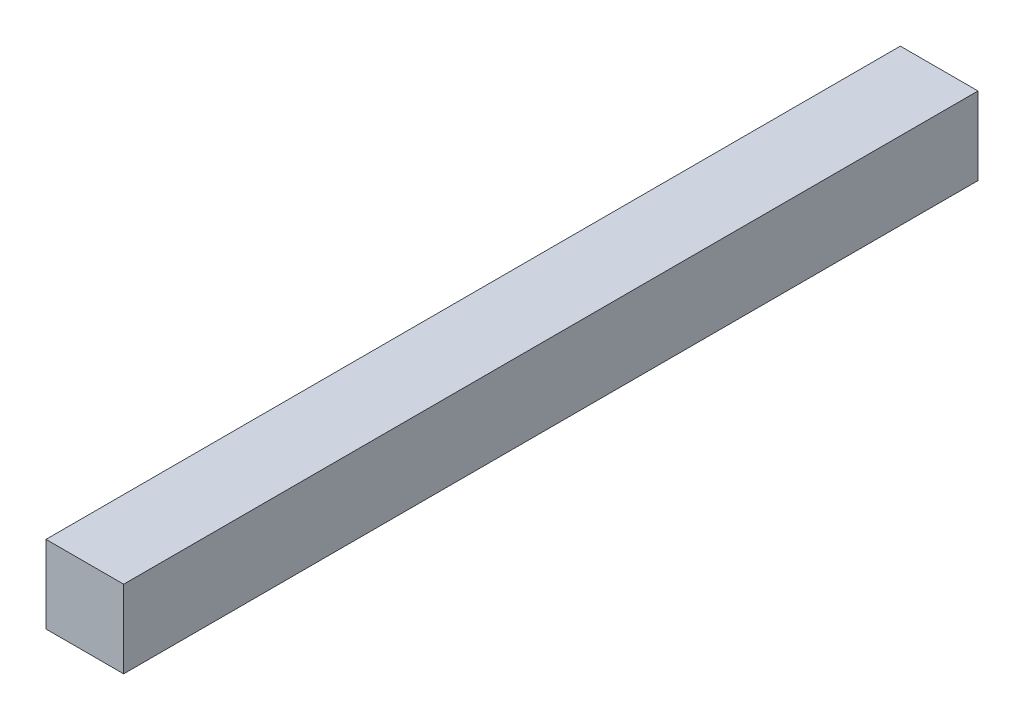
ISO-10303-21;
HEADER;
FILE_DESCRIPTION(('STEP AP214'),'2;1');
FILE_NAME('part.step','',(''),(''),'','','');
FILE_SCHEMA(('AUTOMOTIVE_DESIGN { 1 0 10303 214 1 1 1 1 }'));
ENDSEC;
DATA;
#1=APPLICATION_CONTEXT('core data for automotive mechanical design processes');
#2=APPLICATION_PROTOCOL_DEFINITION('international standard','automotive_design',2000,#1);
#3=PRODUCT_CONTEXT('',#1,'mechanical');
#4=PRODUCT('Part','Part','',(#3));
#5=PRODUCT_RELATED_PRODUCT_CATEGORY('part','',(#4));
#6=PRODUCT_DEFINITION_FORMATION('','',#4);
#7=PRODUCT_DEFINITION_CONTEXT('part definition',#1,'design');
#8=PRODUCT_DEFINITION('design','',#6,#7);
#9=PRODUCT_DEFINITION_SHAPE('','',#8);
#10=(LENGTH_UNIT() NAMED_UNIT(*) SI_UNIT(.MILLI.,.METRE.));
#11=(NAMED_UNIT(*) PLANE_ANGLE_UNIT() SI_UNIT($,.RADIAN.));
#12=(NAMED_UNIT(*) SI_UNIT($,.STERADIAN.) SOLID_ANGLE_UNIT());
#13=UNCERTAINTY_MEASURE_WITH_UNIT(LENGTH_MEASURE(1.E-05),#10,'distance_accuracy_value','');
#14=(GEOMETRIC_REPRESENTATION_CONTEXT(3) GLOBAL_UNCERTAINTY_ASSIGNED_CONTEXT((#13)) GLOBAL_UNIT_ASSIGNED_CONTEXT((#10,
#11,#12)) REPRESENTATION_CONTEXT('',''));
#15=CARTESIAN_POINT('',(0.,0.,0.));
#16=DIRECTION('',(0.,0.,1.));
#17=DIRECTION('',(1.,0.,0.));
#18=AXIS2_PLACEMENT_3D('',#15,#16,#17);
#19=CARTESIAN_POINT('',(0.,0.,279.4));
#20=DIRECTION('',(-1.,0.,0.));
#21=DIRECTION('',(0.,0.,1.));
#22=AXIS2_PLACEMENT_3D('',#19,#20,#21);
#23=PLANE('',#22);
#24=DIRECTION('',(0.,1.,0.));
#25=VECTOR('',#24,1.);
#26=CARTESIAN_POINT('',(0.,0.,0.));
#27=LINE('',#26,#25);
#28=CARTESIAN_POINT('',(0.,0.,0.));
#29=VERTEX_POINT('',#28);
#30=CARTESIAN_POINT('',(0.,25.4,0.));
#31=VERTEX_POINT('',#30);
#32=EDGE_CURVE('E95',#29,#31,#27,.T.);
#33=ORIENTED_EDGE('',*,*,#32,.T.);
#34=DIRECTION('',(0.,0.,-1.));
#35=VECTOR('',#34,1.);
#36=CARTESIAN_POINT('',(0.,25.4,279.4));
#37=LINE('',#36,#35);
#38=CARTESIAN_POINT('',(0.,25.4,279.4));
#39=VERTEX_POINT('',#38);
#40=EDGE_CURVE('E11',#39,#31,#37,.T.);
#41=ORIENTED_EDGE('',*,*,#40,.F.);
#42=DIRECTION('',(0.,1.,0.));
#43=VECTOR('',#42,1.);
#44=CARTESIAN_POINT('',(0.,0.,279.4));
#45=LINE('',#44,#43);
#46=CARTESIAN_POINT('',(0.,0.,279.4));
#47=VERTEX_POINT('',#46);
#48=EDGE_CURVE('E83',#47,#39,#45,.T.);
#49=ORIENTED_EDGE('',*,*,#48,.F.);
#50=DIRECTION('',(0.,0.,-1.));
#51=VECTOR('',#50,1.);
#52=CARTESIAN_POINT('',(0.,0.,279.4));
#53=LINE('',#52,#51);
#54=EDGE_CURVE('E91',#47,#29,#53,.T.);
#55=ORIENTED_EDGE('',*,*,#54,.T.);
#56=EDGE_LOOP('',(#33,#41,#49,#55));
#57=FACE_BOUND('',#56,.T.);
#58=ADVANCED_FACE('F32',(#57),#23,.F.);
#59=CARTESIAN_POINT('',(0.,25.4,279.4));
#60=DIRECTION('',(0.,-1.,0.));
#61=DIRECTION('',(1.,0.,0.));
#62=AXIS2_PLACEMENT_3D('',#59,#60,#61);
#63=PLANE('',#62);
#64=DIRECTION('',(-1.,0.,0.));
#65=VECTOR('',#64,1.);
#66=CARTESIAN_POINT('',(0.,25.4,0.));
#67=LINE('',#66,#65);
#68=CARTESIAN_POINT('',(-25.4,25.4,0.));
#69=VERTEX_POINT('',#68);
#70=EDGE_CURVE('E87',#31,#69,#67,.T.);
#71=ORIENTED_EDGE('',*,*,#70,.T.);
#72=DIRECTION('',(0.,0.,-1.));
#73=VECTOR('',#72,1.);
#74=CARTESIAN_POINT('',(-25.4,25.4,279.4));
#75=LINE('',#74,#73);
#76=CARTESIAN_POINT('',(-25.4,25.4,279.4));
#77=VERTEX_POINT('',#76);
#78=EDGE_CURVE('E40',#77,#69,#75,.T.);
#79=ORIENTED_EDGE('',*,*,#78,.F.);
#80=DIRECTION('',(-1.,0.,0.));
#81=VECTOR('',#80,1.);
#82=CARTESIAN_POINT('',(0.,25.4,279.4));
#83=LINE('',#82,#81);
#84=EDGE_CURVE('E78',#39,#77,#83,.T.);
#85=ORIENTED_EDGE('',*,*,#84,.F.);
#86=ORIENTED_EDGE('',*,*,#40,.T.);
#87=EDGE_LOOP('',(#71,#79,#85,#86));
#88=FACE_BOUND('',#87,.T.);
#89=ADVANCED_FACE('F86',(#88),#63,.F.);
#90=CARTESIAN_POINT('',(-25.4,0.,279.4));
#91=DIRECTION('',(1.,0.,0.));
#92=DIRECTION('',(0.,0.,-1.));
#93=AXIS2_PLACEMENT_3D('',#90,#91,#92);
#94=PLANE('',#93);
#95=DIRECTION('',(0.,-1.,0.));
#96=VECTOR('',#95,1.);
#97=CARTESIAN_POINT('',(-25.4,0.,0.));
#98=LINE('',#97,#96);
#99=CARTESIAN_POINT('',(-25.4,0.,0.));
#100=VERTEX_POINT('',#99);
#101=EDGE_CURVE('E65',#69,#100,#98,.T.);
#102=ORIENTED_EDGE('',*,*,#101,.T.);
#103=DIRECTION('',(0.,0.,-1.));
#104=VECTOR('',#103,1.);
#105=CARTESIAN_POINT('',(-25.4,0.,279.4));
#106=LINE('',#105,#104);
#107=CARTESIAN_POINT('',(-25.4,0.,279.4));
#108=VERTEX_POINT('',#107);
#109=EDGE_CURVE('E88',#108,#100,#106,.T.);
#110=ORIENTED_EDGE('',*,*,#109,.F.);
#111=DIRECTION('',(0.,-1.,0.));
#112=VECTOR('',#111,1.);
#113=CARTESIAN_POINT('',(-25.4,0.,279.4));
#114=LINE('',#113,#112);
#115=EDGE_CURVE('E81',#77,#108,#114,.T.);
#116=ORIENTED_EDGE('',*,*,#115,.F.);
#117=ORIENTED_EDGE('',*,*,#78,.T.);
#118=EDGE_LOOP('',(#102,#110,#116,#117));
#119=FACE_BOUND('',#118,.T.);
#120=ADVANCED_FACE('F89',(#119),#94,.F.);
#121=CARTESIAN_POINT('',(0.,0.,279.4));
#122=DIRECTION('',(0.,1.,0.));
#123=DIRECTION('',(0.,0.,1.));
#124=AXIS2_PLACEMENT_3D('',#121,#122,#123);
#125=PLANE('',#124);
#126=DIRECTION('',(1.,0.,0.));
#127=VECTOR('',#126,1.);
#128=CARTESIAN_POINT('',(0.,0.,0.));
#129=LINE('',#128,#127);
#130=EDGE_CURVE('E71',#100,#29,#129,.T.);
#131=ORIENTED_EDGE('',*,*,#130,.T.);
#132=ORIENTED_EDGE('',*,*,#54,.F.);
#133=DIRECTION('',(1.,0.,0.));
#134=VECTOR('',#133,1.);
#135=CARTESIAN_POINT('',(0.,0.,279.4));
#136=LINE('',#135,#134);
#137=EDGE_CURVE('E48',#108,#47,#136,.T.);
#138=ORIENTED_EDGE('',*,*,#137,.F.);
#139=ORIENTED_EDGE('',*,*,#109,.T.);
#140=EDGE_LOOP('',(#131,#132,#138,#139));
#141=FACE_BOUND('',#140,.T.);
#142=ADVANCED_FACE('F102',(#141),#125,.F.);
#143=CARTESIAN_POINT('',(0.,0.,279.4));
#144=DIRECTION('',(0.,0.,1.));
#145=DIRECTION('',(1.,0.,0.));
#146=AXIS2_PLACEMENT_3D('',#143,#144,#145);
#147=PLANE('',#146);
#148=ORIENTED_EDGE('',*,*,#48,.T.);
#149=ORIENTED_EDGE('',*,*,#84,.T.);
#150=ORIENTED_EDGE('',*,*,#115,.T.);
#151=ORIENTED_EDGE('',*,*,#137,.T.);
#152=EDGE_LOOP('',(#148,#149,#150,#151));
#153=FACE_BOUND('',#152,.T.);
#154=ADVANCED_FACE('F79',(#153),#147,.T.);
#155=CARTESIAN_POINT('',(0.,0.,0.));
#156=DIRECTION('',(0.,0.,1.));
#157=DIRECTION('',(1.,0.,0.));
#158=AXIS2_PLACEMENT_3D('',#155,#156,#157);
#159=PLANE('',#158);
#160=ORIENTED_EDGE('',*,*,#32,.F.);
#161=ORIENTED_EDGE('',*,*,#130,.F.);
#162=ORIENTED_EDGE('',*,*,#101,.F.);
#163=ORIENTED_EDGE('',*,*,#70,.F.);
#164=EDGE_LOOP('',(#160,#161,#162,#163));
#165=FACE_BOUND('',#164,.T.);
#166=ADVANCED_FACE('F105',(#165),#159,.F.);
#167=CLOSED_SHELL('',(#58,#89,#120,#142,#154,#166));
#168=MANIFOLD_SOLID_BREP('B2',#167);
#169=ADVANCED_BREP_SHAPE_REPRESENTATION('',(#18,#168),#14);
#170=SHAPE_DEFINITION_REPRESENTATION(#9,#169);
ENDSEC;
END-ISO-10303-21;
